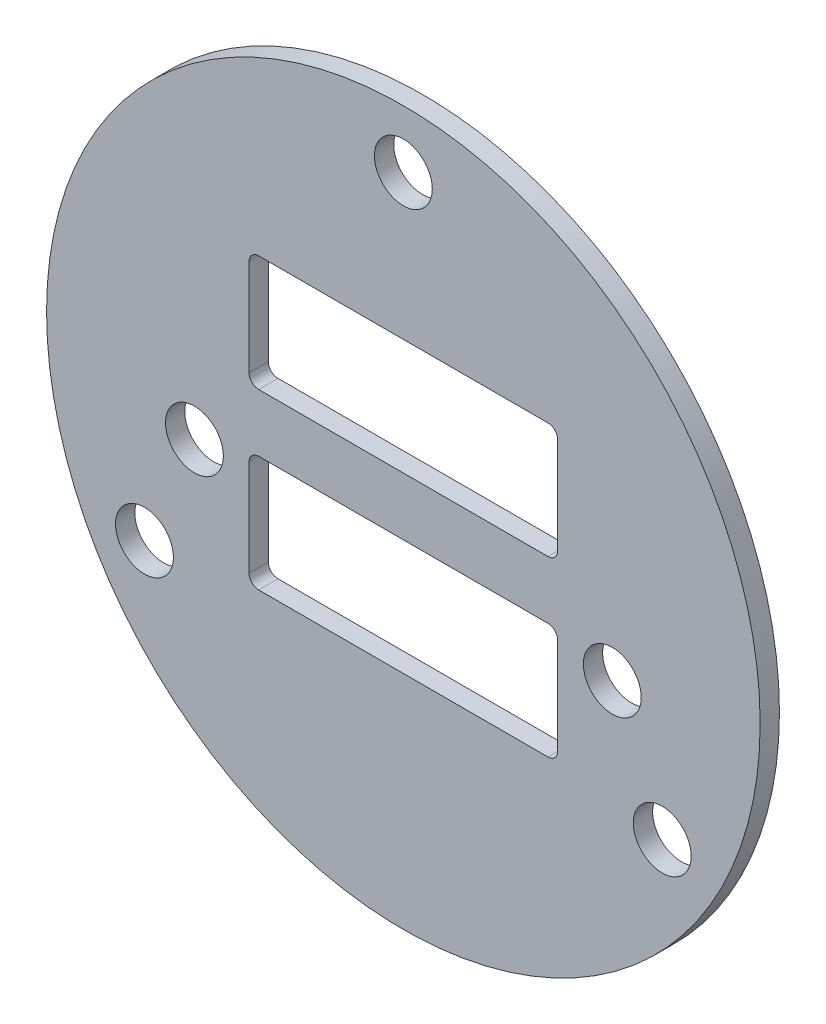
ISO-10303-21;
HEADER;
FILE_DESCRIPTION(('STEP AP214'),'2;1');
FILE_NAME('part.step','',(''),(''),'','','');
FILE_SCHEMA(('AUTOMOTIVE_DESIGN { 1 0 10303 214 1 1 1 1 }'));
ENDSEC;
DATA;
#1=APPLICATION_CONTEXT('core data for automotive mechanical design processes');
#2=APPLICATION_PROTOCOL_DEFINITION('international standard','automotive_design',2000,#1);
#3=PRODUCT_CONTEXT('',#1,'mechanical');
#4=PRODUCT('Part','Part','',(#3));
#5=PRODUCT_RELATED_PRODUCT_CATEGORY('part','',(#4));
#6=PRODUCT_DEFINITION_FORMATION('','',#4);
#7=PRODUCT_DEFINITION_CONTEXT('part definition',#1,'design');
#8=PRODUCT_DEFINITION('design','',#6,#7);
#9=PRODUCT_DEFINITION_SHAPE('','',#8);
#10=(LENGTH_UNIT() NAMED_UNIT(*) SI_UNIT(.MILLI.,.METRE.));
#11=(NAMED_UNIT(*) PLANE_ANGLE_UNIT() SI_UNIT($,.RADIAN.));
#12=(NAMED_UNIT(*) SI_UNIT($,.STERADIAN.) SOLID_ANGLE_UNIT());
#13=UNCERTAINTY_MEASURE_WITH_UNIT(LENGTH_MEASURE(1.E-05),#10,'distance_accuracy_value','');
#14=(GEOMETRIC_REPRESENTATION_CONTEXT(3) GLOBAL_UNCERTAINTY_ASSIGNED_CONTEXT((#13)) GLOBAL_UNIT_ASSIGNED_CONTEXT((#10,
#11,#12)) REPRESENTATION_CONTEXT('',''));
#15=CARTESIAN_POINT('',(0.,0.,0.));
#16=DIRECTION('',(0.,0.,1.));
#17=DIRECTION('',(1.,0.,0.));
#18=AXIS2_PLACEMENT_3D('',#15,#16,#17);
#19=CARTESIAN_POINT('',(0.,0.,0.));
#20=DIRECTION('',(0.,0.,-1.));
#21=DIRECTION('',(-1.,0.,0.));
#22=AXIS2_PLACEMENT_3D('',#19,#20,#21);
#23=PLANE('',#22);
#24=CARTESIAN_POINT('',(0.,0.,0.));
#25=DIRECTION('',(0.,0.,1.));
#26=DIRECTION('',(1.,0.,0.));
#27=AXIS2_PLACEMENT_3D('',#24,#25,#26);
#28=CIRCLE('',#27,18.5);
#29=CARTESIAN_POINT('',(18.5,0.,0.));
#30=VERTEX_POINT('',#29);
#31=EDGE_CURVE('E216',#30,#30,#28,.T.);
#32=ORIENTED_EDGE('',*,*,#31,.F.);
#33=EDGE_LOOP('',(#32));
#34=FACE_BOUND('',#33,.T.);
#35=DIRECTION('',(1.,0.,0.));
#36=VECTOR('',#35,1.);
#37=CARTESIAN_POINT('',(7.5,8.,0.));
#38=LINE('',#37,#36);
#39=CARTESIAN_POINT('',(7.5,8.,0.));
#40=VERTEX_POINT('',#39);
#41=CARTESIAN_POINT('',(-7.5,8.,0.));
#42=VERTEX_POINT('',#41);
#43=EDGE_CURVE('E452',#40,#42,#38,.F.);
#44=ORIENTED_EDGE('',*,*,#43,.T.);
#45=CARTESIAN_POINT('',(-7.5,7.5,0.));
#46=DIRECTION('',(0.,0.,-1.));
#47=DIRECTION('',(-1.,0.,0.));
#48=AXIS2_PLACEMENT_3D('',#45,#46,#47);
#49=CIRCLE('',#48,0.500000000000002);
#50=CARTESIAN_POINT('',(-8.,7.5,0.));
#51=VERTEX_POINT('',#50);
#52=EDGE_CURVE('E220',#42,#51,#49,.F.);
#53=ORIENTED_EDGE('',*,*,#52,.T.);
#54=DIRECTION('',(0.,-1.,0.));
#55=VECTOR('',#54,1.);
#56=CARTESIAN_POINT('',(-8.,7.5,0.));
#57=LINE('',#56,#55);
#58=CARTESIAN_POINT('',(-8.,2.5,0.));
#59=VERTEX_POINT('',#58);
#60=EDGE_CURVE('E219',#51,#59,#57,.T.);
#61=ORIENTED_EDGE('',*,*,#60,.T.);
#62=CARTESIAN_POINT('',(-7.5,2.5,0.));
#63=DIRECTION('',(0.,0.,-1.));
#64=DIRECTION('',(-1.,0.,0.));
#65=AXIS2_PLACEMENT_3D('',#62,#63,#64);
#66=CIRCLE('',#65,0.500000000000001);
#67=CARTESIAN_POINT('',(-7.5,2.,0.));
#68=VERTEX_POINT('',#67);
#69=EDGE_CURVE('E152',#59,#68,#66,.F.);
#70=ORIENTED_EDGE('',*,*,#69,.T.);
#71=DIRECTION('',(1.,0.,0.));
#72=VECTOR('',#71,1.);
#73=CARTESIAN_POINT('',(-7.5,2.,0.));
#74=LINE('',#73,#72);
#75=CARTESIAN_POINT('',(7.5,2.,0.));
#76=VERTEX_POINT('',#75);
#77=EDGE_CURVE('E159',#68,#76,#74,.T.);
#78=ORIENTED_EDGE('',*,*,#77,.T.);
#79=CARTESIAN_POINT('',(7.5,2.5,0.));
#80=DIRECTION('',(0.,0.,-1.));
#81=DIRECTION('',(-1.,0.,0.));
#82=AXIS2_PLACEMENT_3D('',#79,#80,#81);
#83=CIRCLE('',#82,0.5);
#84=CARTESIAN_POINT('',(8.,2.5,0.));
#85=VERTEX_POINT('',#84);
#86=EDGE_CURVE('E228',#76,#85,#83,.F.);
#87=ORIENTED_EDGE('',*,*,#86,.T.);
#88=DIRECTION('',(0.,1.,0.));
#89=VECTOR('',#88,1.);
#90=CARTESIAN_POINT('',(8.,2.5,0.));
#91=LINE('',#90,#89);
#92=CARTESIAN_POINT('',(8.,7.5,0.));
#93=VERTEX_POINT('',#92);
#94=EDGE_CURVE('E469',#85,#93,#91,.T.);
#95=ORIENTED_EDGE('',*,*,#94,.T.);
#96=CARTESIAN_POINT('',(7.5,7.5,0.));
#97=DIRECTION('',(0.,0.,-1.));
#98=DIRECTION('',(-1.,0.,0.));
#99=AXIS2_PLACEMENT_3D('',#96,#97,#98);
#100=CIRCLE('',#99,0.500000000000002);
#101=EDGE_CURVE('E224',#93,#40,#100,.F.);
#102=ORIENTED_EDGE('',*,*,#101,.T.);
#103=EDGE_LOOP('',(#44,#53,#61,#70,#78,#87,#95,#102));
#104=FACE_BOUND('',#103,.T.);
#105=DIRECTION('',(1.,0.,0.));
#106=VECTOR('',#105,1.);
#107=CARTESIAN_POINT('',(7.5,-0.999999999999999,0.));
#108=LINE('',#107,#106);
#109=CARTESIAN_POINT('',(7.5,-0.999999999999999,0.));
#110=VERTEX_POINT('',#109);
#111=CARTESIAN_POINT('',(-7.5,-1.,0.));
#112=VERTEX_POINT('',#111);
#113=EDGE_CURVE('E161',#110,#112,#108,.F.);
#114=ORIENTED_EDGE('',*,*,#113,.T.);
#115=CARTESIAN_POINT('',(-7.5,-1.5,0.));
#116=DIRECTION('',(0.,0.,-1.));
#117=DIRECTION('',(-1.,0.,0.));
#118=AXIS2_PLACEMENT_3D('',#115,#116,#117);
#119=CIRCLE('',#118,0.500000000000001);
#120=CARTESIAN_POINT('',(-8.,-1.5,0.));
#121=VERTEX_POINT('',#120);
#122=EDGE_CURVE('E148',#112,#121,#119,.F.);
#123=ORIENTED_EDGE('',*,*,#122,.T.);
#124=DIRECTION('',(0.,-1.,0.));
#125=VECTOR('',#124,1.);
#126=CARTESIAN_POINT('',(-8.,-1.5,0.));
#127=LINE('',#126,#125);
#128=CARTESIAN_POINT('',(-8.,-6.5,0.));
#129=VERTEX_POINT('',#128);
#130=EDGE_CURVE('E143',#121,#129,#127,.T.);
#131=ORIENTED_EDGE('',*,*,#130,.T.);
#132=CARTESIAN_POINT('',(-7.5,-6.5,0.));
#133=DIRECTION('',(0.,0.,-1.));
#134=DIRECTION('',(-1.,0.,0.));
#135=AXIS2_PLACEMENT_3D('',#132,#133,#134);
#136=CIRCLE('',#135,0.499999999999999);
#137=CARTESIAN_POINT('',(-7.5,-7.,0.));
#138=VERTEX_POINT('',#137);
#139=EDGE_CURVE('E128',#129,#138,#136,.F.);
#140=ORIENTED_EDGE('',*,*,#139,.T.);
#141=DIRECTION('',(1.,0.,0.));
#142=VECTOR('',#141,1.);
#143=CARTESIAN_POINT('',(-7.5,-7.,0.));
#144=LINE('',#143,#142);
#145=CARTESIAN_POINT('',(7.5,-7.,0.));
#146=VERTEX_POINT('',#145);
#147=EDGE_CURVE('E169',#138,#146,#144,.T.);
#148=ORIENTED_EDGE('',*,*,#147,.T.);
#149=CARTESIAN_POINT('',(7.5,-6.5,0.));
#150=DIRECTION('',(0.,0.,-1.));
#151=DIRECTION('',(-1.,0.,0.));
#152=AXIS2_PLACEMENT_3D('',#149,#150,#151);
#153=CIRCLE('',#152,0.499999999999999);
#154=CARTESIAN_POINT('',(8.,-6.5,0.));
#155=VERTEX_POINT('',#154);
#156=EDGE_CURVE('E235',#146,#155,#153,.F.);
#157=ORIENTED_EDGE('',*,*,#156,.T.);
#158=DIRECTION('',(0.,1.,0.));
#159=VECTOR('',#158,1.);
#160=CARTESIAN_POINT('',(8.,-6.5,0.));
#161=LINE('',#160,#159);
#162=CARTESIAN_POINT('',(8.,-1.5,0.));
#163=VERTEX_POINT('',#162);
#164=EDGE_CURVE('E165',#155,#163,#161,.T.);
#165=ORIENTED_EDGE('',*,*,#164,.T.);
#166=CARTESIAN_POINT('',(7.5,-1.5,0.));
#167=DIRECTION('',(0.,0.,-1.));
#168=DIRECTION('',(-1.,0.,0.));
#169=AXIS2_PLACEMENT_3D('',#166,#167,#168);
#170=CIRCLE('',#169,0.5);
#171=EDGE_CURVE('E233',#163,#110,#170,.F.);
#172=ORIENTED_EDGE('',*,*,#171,.T.);
#173=EDGE_LOOP('',(#114,#123,#131,#140,#148,#157,#165,#172));
#174=FACE_BOUND('',#173,.T.);
#175=CARTESIAN_POINT('',(13.4233937586588,-7.74999999999999,0.));
#176=DIRECTION('',(0.,0.,1.));
#177=DIRECTION('',(1.,0.,0.));
#178=AXIS2_PLACEMENT_3D('',#175,#176,#177);
#179=CIRCLE('',#178,1.5);
#180=CARTESIAN_POINT('',(14.9233937586588,-7.74999999999999,0.));
#181=VERTEX_POINT('',#180);
#182=EDGE_CURVE('E138',#181,#181,#179,.T.);
#183=ORIENTED_EDGE('',*,*,#182,.T.);
#184=EDGE_LOOP('',(#183));
#185=FACE_BOUND('',#184,.T.);
#186=CARTESIAN_POINT('',(0.,15.5,0.));
#187=DIRECTION('',(0.,0.,1.));
#188=DIRECTION('',(1.,0.,0.));
#189=AXIS2_PLACEMENT_3D('',#186,#187,#188);
#190=CIRCLE('',#189,1.5);
#191=CARTESIAN_POINT('',(1.5,15.5,0.));
#192=VERTEX_POINT('',#191);
#193=EDGE_CURVE('E239',#192,#192,#190,.T.);
#194=ORIENTED_EDGE('',*,*,#193,.T.);
#195=EDGE_LOOP('',(#194));
#196=FACE_BOUND('',#195,.T.);
#197=CARTESIAN_POINT('',(-13.4233937586588,-7.75,0.));
#198=DIRECTION('',(0.,0.,1.));
#199=DIRECTION('',(1.,0.,0.));
#200=AXIS2_PLACEMENT_3D('',#197,#198,#199);
#201=CIRCLE('',#200,1.5);
#202=CARTESIAN_POINT('',(-11.9233937586588,-7.75,0.));
#203=VERTEX_POINT('',#202);
#204=EDGE_CURVE('E242',#203,#203,#201,.T.);
#205=ORIENTED_EDGE('',*,*,#204,.T.);
#206=EDGE_LOOP('',(#205));
#207=FACE_BOUND('',#206,.T.);
#208=CARTESIAN_POINT('',(10.8328852831343,-1.91012995433623,0.));
#209=DIRECTION('',(0.,0.,1.));
#210=DIRECTION('',(1.,0.,0.));
#211=AXIS2_PLACEMENT_3D('',#208,#209,#210);
#212=CIRCLE('',#211,1.5);
#213=CARTESIAN_POINT('',(12.3328852831343,-1.91012995433623,0.));
#214=VERTEX_POINT('',#213);
#215=EDGE_CURVE('E244',#214,#214,#212,.T.);
#216=ORIENTED_EDGE('',*,*,#215,.T.);
#217=EDGE_LOOP('',(#216));
#218=FACE_BOUND('',#217,.T.);
#219=CARTESIAN_POINT('',(-10.8328852831343,-1.91012995433623,0.));
#220=DIRECTION('',(0.,0.,1.));
#221=DIRECTION('',(1.,0.,0.));
#222=AXIS2_PLACEMENT_3D('',#219,#220,#221);
#223=CIRCLE('',#222,1.5);
#224=CARTESIAN_POINT('',(-9.33288528313429,-1.91012995433623,0.));
#225=VERTEX_POINT('',#224);
#226=EDGE_CURVE('E19',#225,#225,#223,.T.);
#227=ORIENTED_EDGE('',*,*,#226,.T.);
#228=EDGE_LOOP('',(#227));
#229=FACE_BOUND('',#228,.T.);
#230=ADVANCED_FACE('F16',(#34,#104,#174,#185,#196,#207,#218,#229),#23,.T.);
#231=CARTESIAN_POINT('',(-10.8328852831343,-1.91012995433623,-3.));
#232=DIRECTION('',(0.,0.,1.));
#233=DIRECTION('',(1.,0.,0.));
#234=AXIS2_PLACEMENT_3D('',#231,#232,#233);
#235=CYLINDRICAL_SURFACE('',#234,1.5);
#236=ORIENTED_EDGE('',*,*,#226,.F.);
#237=EDGE_LOOP('',(#236));
#238=FACE_BOUND('',#237,.T.);
#239=CARTESIAN_POINT('',(-10.8328852831343,-1.91012995433623,1.));
#240=DIRECTION('',(0.,0.,1.));
#241=DIRECTION('',(1.,0.,0.));
#242=AXIS2_PLACEMENT_3D('',#239,#240,#241);
#243=CIRCLE('',#242,1.5);
#244=CARTESIAN_POINT('',(-9.33288528313429,-1.91012995433623,1.));
#245=VERTEX_POINT('',#244);
#246=EDGE_CURVE('E213',#245,#245,#243,.T.);
#247=ORIENTED_EDGE('',*,*,#246,.T.);
#248=EDGE_LOOP('',(#247));
#249=FACE_BOUND('',#248,.T.);
#250=ADVANCED_FACE('F252',(#238,#249),#235,.F.);
#251=CARTESIAN_POINT('',(10.8328852831343,-1.91012995433623,-3.));
#252=DIRECTION('',(0.,0.,1.));
#253=DIRECTION('',(1.,0.,0.));
#254=AXIS2_PLACEMENT_3D('',#251,#252,#253);
#255=CYLINDRICAL_SURFACE('',#254,1.5);
#256=ORIENTED_EDGE('',*,*,#215,.F.);
#257=EDGE_LOOP('',(#256));
#258=FACE_BOUND('',#257,.T.);
#259=CARTESIAN_POINT('',(10.8328852831343,-1.91012995433623,1.));
#260=DIRECTION('',(0.,0.,1.));
#261=DIRECTION('',(1.,0.,0.));
#262=AXIS2_PLACEMENT_3D('',#259,#260,#261);
#263=CIRCLE('',#262,1.5);
#264=CARTESIAN_POINT('',(12.3328852831343,-1.91012995433623,1.));
#265=VERTEX_POINT('',#264);
#266=EDGE_CURVE('E210',#265,#265,#263,.T.);
#267=ORIENTED_EDGE('',*,*,#266,.T.);
#268=EDGE_LOOP('',(#267));
#269=FACE_BOUND('',#268,.T.);
#270=ADVANCED_FACE('F255',(#258,#269),#255,.F.);
#271=CARTESIAN_POINT('',(-13.4233937586588,-7.75,0.5));
#272=DIRECTION('',(0.,0.,1.));
#273=DIRECTION('',(1.,0.,0.));
#274=AXIS2_PLACEMENT_3D('',#271,#272,#273);
#275=CYLINDRICAL_SURFACE('',#274,1.5);
#276=ORIENTED_EDGE('',*,*,#204,.F.);
#277=EDGE_LOOP('',(#276));
#278=FACE_BOUND('',#277,.T.);
#279=CARTESIAN_POINT('',(-13.4233937586588,-7.75,1.));
#280=DIRECTION('',(0.,0.,1.));
#281=DIRECTION('',(1.,0.,0.));
#282=AXIS2_PLACEMENT_3D('',#279,#280,#281);
#283=CIRCLE('',#282,1.5);
#284=CARTESIAN_POINT('',(-11.9233937586588,-7.75,1.));
#285=VERTEX_POINT('',#284);
#286=EDGE_CURVE('E207',#285,#285,#283,.T.);
#287=ORIENTED_EDGE('',*,*,#286,.T.);
#288=EDGE_LOOP('',(#287));
#289=FACE_BOUND('',#288,.T.);
#290=ADVANCED_FACE('F338',(#278,#289),#275,.F.);
#291=CARTESIAN_POINT('',(0.,15.5,0.5));
#292=DIRECTION('',(0.,0.,1.));
#293=DIRECTION('',(1.,0.,0.));
#294=AXIS2_PLACEMENT_3D('',#291,#292,#293);
#295=CYLINDRICAL_SURFACE('',#294,1.5);
#296=ORIENTED_EDGE('',*,*,#193,.F.);
#297=EDGE_LOOP('',(#296));
#298=FACE_BOUND('',#297,.T.);
#299=CARTESIAN_POINT('',(0.,15.5,1.));
#300=DIRECTION('',(0.,0.,1.));
#301=DIRECTION('',(1.,0.,0.));
#302=AXIS2_PLACEMENT_3D('',#299,#300,#301);
#303=CIRCLE('',#302,1.5);
#304=CARTESIAN_POINT('',(1.5,15.5,1.));
#305=VERTEX_POINT('',#304);
#306=EDGE_CURVE('E204',#305,#305,#303,.T.);
#307=ORIENTED_EDGE('',*,*,#306,.T.);
#308=EDGE_LOOP('',(#307));
#309=FACE_BOUND('',#308,.T.);
#310=ADVANCED_FACE('F334',(#298,#309),#295,.F.);
#311=CARTESIAN_POINT('',(13.4233937586588,-7.74999999999999,0.5));
#312=DIRECTION('',(0.,0.,1.));
#313=DIRECTION('',(1.,0.,0.));
#314=AXIS2_PLACEMENT_3D('',#311,#312,#313);
#315=CYLINDRICAL_SURFACE('',#314,1.5);
#316=ORIENTED_EDGE('',*,*,#182,.F.);
#317=EDGE_LOOP('',(#316));
#318=FACE_BOUND('',#317,.T.);
#319=CARTESIAN_POINT('',(13.4233937586588,-7.74999999999999,1.));
#320=DIRECTION('',(0.,0.,1.));
#321=DIRECTION('',(1.,0.,0.));
#322=AXIS2_PLACEMENT_3D('',#319,#320,#321);
#323=CIRCLE('',#322,1.5);
#324=CARTESIAN_POINT('',(14.9233937586588,-7.74999999999999,1.));
#325=VERTEX_POINT('',#324);
#326=EDGE_CURVE('E201',#325,#325,#323,.T.);
#327=ORIENTED_EDGE('',*,*,#326,.T.);
#328=EDGE_LOOP('',(#327));
#329=FACE_BOUND('',#328,.T.);
#330=ADVANCED_FACE('F331',(#318,#329),#315,.F.);
#331=CARTESIAN_POINT('',(-7.5,-6.5,1.));
#332=DIRECTION('',(0.,0.,-1.));
#333=DIRECTION('',(-1.,0.,0.));
#334=AXIS2_PLACEMENT_3D('',#331,#332,#333);
#335=CYLINDRICAL_SURFACE('',#334,0.499999999999999);
#336=DIRECTION('',(0.,0.,1.));
#337=VECTOR('',#336,1.);
#338=CARTESIAN_POINT('',(-8.,-6.5,1.));
#339=LINE('',#338,#337);
#340=CARTESIAN_POINT('',(-8.,-6.5,1.));
#341=VERTEX_POINT('',#340);
#342=EDGE_CURVE('E132',#129,#341,#339,.T.);
#343=ORIENTED_EDGE('',*,*,#342,.T.);
#344=CARTESIAN_POINT('',(-7.5,-6.5,1.));
#345=DIRECTION('',(0.,0.,-1.));
#346=DIRECTION('',(-1.,0.,0.));
#347=AXIS2_PLACEMENT_3D('',#344,#345,#346);
#348=CIRCLE('',#347,0.499999999999999);
#349=CARTESIAN_POINT('',(-7.5,-7.,1.));
#350=VERTEX_POINT('',#349);
#351=EDGE_CURVE('E199',#341,#350,#348,.F.);
#352=ORIENTED_EDGE('',*,*,#351,.T.);
#353=DIRECTION('',(0.,0.,-1.));
#354=VECTOR('',#353,1.);
#355=CARTESIAN_POINT('',(-7.5,-7.,1.));
#356=LINE('',#355,#354);
#357=EDGE_CURVE('E134',#350,#138,#356,.T.);
#358=ORIENTED_EDGE('',*,*,#357,.T.);
#359=ORIENTED_EDGE('',*,*,#139,.F.);
#360=EDGE_LOOP('',(#343,#352,#358,#359));
#361=FACE_BOUND('',#360,.T.);
#362=ADVANCED_FACE('F130',(#361),#335,.F.);
#363=CARTESIAN_POINT('',(-7.5,-7.,1.));
#364=DIRECTION('',(0.,-1.,0.));
#365=DIRECTION('',(0.,0.,-1.));
#366=AXIS2_PLACEMENT_3D('',#363,#364,#365);
#367=PLANE('',#366);
#368=ORIENTED_EDGE('',*,*,#357,.F.);
#369=DIRECTION('',(-1.,0.,0.));
#370=VECTOR('',#369,1.);
#371=CARTESIAN_POINT('',(0.,-7.,1.));
#372=LINE('',#371,#370);
#373=CARTESIAN_POINT('',(7.5,-7.,1.));
#374=VERTEX_POINT('',#373);
#375=EDGE_CURVE('E198',#350,#374,#372,.F.);
#376=ORIENTED_EDGE('',*,*,#375,.T.);
#377=DIRECTION('',(0.,0.,-1.));
#378=VECTOR('',#377,1.);
#379=CARTESIAN_POINT('',(7.5,-7.,1.));
#380=LINE('',#379,#378);
#381=EDGE_CURVE('E170',#374,#146,#380,.T.);
#382=ORIENTED_EDGE('',*,*,#381,.T.);
#383=ORIENTED_EDGE('',*,*,#147,.F.);
#384=EDGE_LOOP('',(#368,#376,#382,#383));
#385=FACE_BOUND('',#384,.T.);
#386=ADVANCED_FACE('F324',(#385),#367,.F.);
#387=CARTESIAN_POINT('',(7.5,-6.5,1.));
#388=DIRECTION('',(0.,0.,-1.));
#389=DIRECTION('',(-1.,0.,0.));
#390=AXIS2_PLACEMENT_3D('',#387,#388,#389);
#391=CYLINDRICAL_SURFACE('',#390,0.499999999999999);
#392=ORIENTED_EDGE('',*,*,#381,.F.);
#393=CARTESIAN_POINT('',(7.5,-6.5,1.));
#394=DIRECTION('',(0.,0.,-1.));
#395=DIRECTION('',(-1.,0.,0.));
#396=AXIS2_PLACEMENT_3D('',#393,#394,#395);
#397=CIRCLE('',#396,0.499999999999999);
#398=CARTESIAN_POINT('',(8.,-6.5,1.));
#399=VERTEX_POINT('',#398);
#400=EDGE_CURVE('E195',#374,#399,#397,.F.);
#401=ORIENTED_EDGE('',*,*,#400,.T.);
#402=DIRECTION('',(0.,0.,-1.));
#403=VECTOR('',#402,1.);
#404=CARTESIAN_POINT('',(8.,-6.5,1.));
#405=LINE('',#404,#403);
#406=EDGE_CURVE('E168',#399,#155,#405,.T.);
#407=ORIENTED_EDGE('',*,*,#406,.T.);
#408=ORIENTED_EDGE('',*,*,#156,.F.);
#409=EDGE_LOOP('',(#392,#401,#407,#408));
#410=FACE_BOUND('',#409,.T.);
#411=ADVANCED_FACE('F320',(#410),#391,.F.);
#412=CARTESIAN_POINT('',(8.,-6.5,1.));
#413=DIRECTION('',(1.,0.,0.));
#414=DIRECTION('',(0.,0.,-1.));
#415=AXIS2_PLACEMENT_3D('',#412,#413,#414);
#416=PLANE('',#415);
#417=ORIENTED_EDGE('',*,*,#406,.F.);
#418=DIRECTION('',(0.,1.,0.));
#419=VECTOR('',#418,1.);
#420=CARTESIAN_POINT('',(8.,0.,1.));
#421=LINE('',#420,#419);
#422=CARTESIAN_POINT('',(8.,-1.5,1.));
#423=VERTEX_POINT('',#422);
#424=EDGE_CURVE('E194',#399,#423,#421,.T.);
#425=ORIENTED_EDGE('',*,*,#424,.T.);
#426=DIRECTION('',(0.,0.,-1.));
#427=VECTOR('',#426,1.);
#428=CARTESIAN_POINT('',(8.,-1.5,1.));
#429=LINE('',#428,#427);
#430=EDGE_CURVE('E167',#423,#163,#429,.T.);
#431=ORIENTED_EDGE('',*,*,#430,.T.);
#432=ORIENTED_EDGE('',*,*,#164,.F.);
#433=EDGE_LOOP('',(#417,#425,#431,#432));
#434=FACE_BOUND('',#433,.T.);
#435=ADVANCED_FACE('F316',(#434),#416,.F.);
#436=CARTESIAN_POINT('',(7.5,-1.5,1.));
#437=DIRECTION('',(0.,0.,-1.));
#438=DIRECTION('',(-1.,0.,0.));
#439=AXIS2_PLACEMENT_3D('',#436,#437,#438);
#440=CYLINDRICAL_SURFACE('',#439,0.5);
#441=ORIENTED_EDGE('',*,*,#430,.F.);
#442=CARTESIAN_POINT('',(7.5,-1.5,1.));
#443=DIRECTION('',(0.,0.,-1.));
#444=DIRECTION('',(-1.,0.,0.));
#445=AXIS2_PLACEMENT_3D('',#442,#443,#444);
#446=CIRCLE('',#445,0.5);
#447=CARTESIAN_POINT('',(7.5,-0.999999999999999,1.));
#448=VERTEX_POINT('',#447);
#449=EDGE_CURVE('E191',#423,#448,#446,.F.);
#450=ORIENTED_EDGE('',*,*,#449,.T.);
#451=DIRECTION('',(0.,0.,1.));
#452=VECTOR('',#451,1.);
#453=CARTESIAN_POINT('',(7.5,-0.999999999999999,1.));
#454=LINE('',#453,#452);
#455=EDGE_CURVE('E164',#448,#110,#454,.F.);
#456=ORIENTED_EDGE('',*,*,#455,.T.);
#457=ORIENTED_EDGE('',*,*,#171,.F.);
#458=EDGE_LOOP('',(#441,#450,#456,#457));
#459=FACE_BOUND('',#458,.T.);
#460=ADVANCED_FACE('F312',(#459),#440,.F.);
#461=CARTESIAN_POINT('',(7.5,-0.999999999999999,1.));
#462=DIRECTION('',(0.,1.,0.));
#463=DIRECTION('',(0.,0.,1.));
#464=AXIS2_PLACEMENT_3D('',#461,#462,#463);
#465=PLANE('',#464);
#466=ORIENTED_EDGE('',*,*,#455,.F.);
#467=DIRECTION('',(-1.,0.,0.));
#468=VECTOR('',#467,1.);
#469=CARTESIAN_POINT('',(0.,-0.999999999999999,1.));
#470=LINE('',#469,#468);
#471=CARTESIAN_POINT('',(-7.5,-1.,1.));
#472=VERTEX_POINT('',#471);
#473=EDGE_CURVE('E190',#448,#472,#470,.T.);
#474=ORIENTED_EDGE('',*,*,#473,.T.);
#475=DIRECTION('',(0.,0.,-1.));
#476=VECTOR('',#475,1.);
#477=CARTESIAN_POINT('',(-7.5,-1.,1.));
#478=LINE('',#477,#476);
#479=EDGE_CURVE('E163',#472,#112,#478,.T.);
#480=ORIENTED_EDGE('',*,*,#479,.T.);
#481=ORIENTED_EDGE('',*,*,#113,.F.);
#482=EDGE_LOOP('',(#466,#474,#480,#481));
#483=FACE_BOUND('',#482,.T.);
#484=ADVANCED_FACE('F308',(#483),#465,.F.);
#485=CARTESIAN_POINT('',(-7.5,-1.5,1.));
#486=DIRECTION('',(0.,0.,-1.));
#487=DIRECTION('',(-1.,0.,0.));
#488=AXIS2_PLACEMENT_3D('',#485,#486,#487);
#489=CYLINDRICAL_SURFACE('',#488,0.500000000000001);
#490=ORIENTED_EDGE('',*,*,#479,.F.);
#491=CARTESIAN_POINT('',(-7.5,-1.5,1.));
#492=DIRECTION('',(0.,0.,-1.));
#493=DIRECTION('',(-1.,0.,0.));
#494=AXIS2_PLACEMENT_3D('',#491,#492,#493);
#495=CIRCLE('',#494,0.500000000000001);
#496=CARTESIAN_POINT('',(-8.,-1.5,1.));
#497=VERTEX_POINT('',#496);
#498=EDGE_CURVE('E187',#472,#497,#495,.F.);
#499=ORIENTED_EDGE('',*,*,#498,.T.);
#500=DIRECTION('',(0.,0.,1.));
#501=VECTOR('',#500,1.);
#502=CARTESIAN_POINT('',(-8.,-1.5,1.));
#503=LINE('',#502,#501);
#504=EDGE_CURVE('E147',#497,#121,#503,.F.);
#505=ORIENTED_EDGE('',*,*,#504,.T.);
#506=ORIENTED_EDGE('',*,*,#122,.F.);
#507=EDGE_LOOP('',(#490,#499,#505,#506));
#508=FACE_BOUND('',#507,.T.);
#509=ADVANCED_FACE('F305',(#508),#489,.F.);
#510=CARTESIAN_POINT('',(-8.,-1.5,1.));
#511=DIRECTION('',(-1.,0.,0.));
#512=DIRECTION('',(0.,-1.,0.));
#513=AXIS2_PLACEMENT_3D('',#510,#511,#512);
#514=PLANE('',#513);
#515=ORIENTED_EDGE('',*,*,#504,.F.);
#516=DIRECTION('',(0.,1.,0.));
#517=VECTOR('',#516,1.);
#518=CARTESIAN_POINT('',(-8.,0.,1.));
#519=LINE('',#518,#517);
#520=EDGE_CURVE('E146',#497,#341,#519,.F.);
#521=ORIENTED_EDGE('',*,*,#520,.T.);
#522=ORIENTED_EDGE('',*,*,#342,.F.);
#523=ORIENTED_EDGE('',*,*,#130,.F.);
#524=EDGE_LOOP('',(#515,#521,#522,#523));
#525=FACE_BOUND('',#524,.T.);
#526=ADVANCED_FACE('F142',(#525),#514,.F.);
#527=CARTESIAN_POINT('',(-7.5,2.5,1.));
#528=DIRECTION('',(0.,0.,-1.));
#529=DIRECTION('',(-1.,0.,0.));
#530=AXIS2_PLACEMENT_3D('',#527,#528,#529);
#531=CYLINDRICAL_SURFACE('',#530,0.500000000000001);
#532=DIRECTION('',(0.,0.,1.));
#533=VECTOR('',#532,1.);
#534=CARTESIAN_POINT('',(-8.,2.5,1.));
#535=LINE('',#534,#533);
#536=CARTESIAN_POINT('',(-8.,2.5,1.));
#537=VERTEX_POINT('',#536);
#538=EDGE_CURVE('E222',#59,#537,#535,.T.);
#539=ORIENTED_EDGE('',*,*,#538,.T.);
#540=CARTESIAN_POINT('',(-7.5,2.5,1.));
#541=DIRECTION('',(0.,0.,-1.));
#542=DIRECTION('',(-1.,0.,0.));
#543=AXIS2_PLACEMENT_3D('',#540,#541,#542);
#544=CIRCLE('',#543,0.500000000000001);
#545=CARTESIAN_POINT('',(-7.5,2.,1.));
#546=VERTEX_POINT('',#545);
#547=EDGE_CURVE('E184',#537,#546,#544,.F.);
#548=ORIENTED_EDGE('',*,*,#547,.T.);
#549=DIRECTION('',(0.,0.,-1.));
#550=VECTOR('',#549,1.);
#551=CARTESIAN_POINT('',(-7.5,2.,1.));
#552=LINE('',#551,#550);
#553=EDGE_CURVE('E154',#546,#68,#552,.T.);
#554=ORIENTED_EDGE('',*,*,#553,.T.);
#555=ORIENTED_EDGE('',*,*,#69,.F.);
#556=EDGE_LOOP('',(#539,#548,#554,#555));
#557=FACE_BOUND('',#556,.T.);
#558=ADVANCED_FACE('F298',(#557),#531,.F.);
#559=CARTESIAN_POINT('',(-7.5,2.,1.));
#560=DIRECTION('',(0.,-1.,0.));
#561=DIRECTION('',(0.,0.,-1.));
#562=AXIS2_PLACEMENT_3D('',#559,#560,#561);
#563=PLANE('',#562);
#564=ORIENTED_EDGE('',*,*,#553,.F.);
#565=DIRECTION('',(-1.,0.,0.));
#566=VECTOR('',#565,1.);
#567=CARTESIAN_POINT('',(0.,2.,1.));
#568=LINE('',#567,#566);
#569=CARTESIAN_POINT('',(7.5,2.,1.));
#570=VERTEX_POINT('',#569);
#571=EDGE_CURVE('E183',#546,#570,#568,.F.);
#572=ORIENTED_EDGE('',*,*,#571,.T.);
#573=DIRECTION('',(0.,0.,-1.));
#574=VECTOR('',#573,1.);
#575=CARTESIAN_POINT('',(7.5,2.,1.));
#576=LINE('',#575,#574);
#577=EDGE_CURVE('E230',#570,#76,#576,.T.);
#578=ORIENTED_EDGE('',*,*,#577,.T.);
#579=ORIENTED_EDGE('',*,*,#77,.F.);
#580=EDGE_LOOP('',(#564,#572,#578,#579));
#581=FACE_BOUND('',#580,.T.);
#582=ADVANCED_FACE('F294',(#581),#563,.F.);
#583=CARTESIAN_POINT('',(7.5,2.5,1.));
#584=DIRECTION('',(0.,0.,-1.));
#585=DIRECTION('',(-1.,0.,0.));
#586=AXIS2_PLACEMENT_3D('',#583,#584,#585);
#587=CYLINDRICAL_SURFACE('',#586,0.5);
#588=ORIENTED_EDGE('',*,*,#577,.F.);
#589=CARTESIAN_POINT('',(7.5,2.5,1.));
#590=DIRECTION('',(0.,0.,-1.));
#591=DIRECTION('',(-1.,0.,0.));
#592=AXIS2_PLACEMENT_3D('',#589,#590,#591);
#593=CIRCLE('',#592,0.5);
#594=CARTESIAN_POINT('',(8.,2.5,1.));
#595=VERTEX_POINT('',#594);
#596=EDGE_CURVE('E180',#570,#595,#593,.F.);
#597=ORIENTED_EDGE('',*,*,#596,.T.);
#598=DIRECTION('',(0.,0.,-1.));
#599=VECTOR('',#598,1.);
#600=CARTESIAN_POINT('',(8.,2.5,1.));
#601=LINE('',#600,#599);
#602=EDGE_CURVE('E229',#595,#85,#601,.T.);
#603=ORIENTED_EDGE('',*,*,#602,.T.);
#604=ORIENTED_EDGE('',*,*,#86,.F.);
#605=EDGE_LOOP('',(#588,#597,#603,#604));
#606=FACE_BOUND('',#605,.T.);
#607=ADVANCED_FACE('F290',(#606),#587,.F.);
#608=CARTESIAN_POINT('',(8.,2.5,1.));
#609=DIRECTION('',(1.,0.,0.));
#610=DIRECTION('',(0.,0.,-1.));
#611=AXIS2_PLACEMENT_3D('',#608,#609,#610);
#612=PLANE('',#611);
#613=ORIENTED_EDGE('',*,*,#602,.F.);
#614=DIRECTION('',(0.,1.,0.));
#615=VECTOR('',#614,1.);
#616=CARTESIAN_POINT('',(8.,0.,1.));
#617=LINE('',#616,#615);
#618=CARTESIAN_POINT('',(8.,7.5,1.));
#619=VERTEX_POINT('',#618);
#620=EDGE_CURVE('E179',#595,#619,#617,.T.);
#621=ORIENTED_EDGE('',*,*,#620,.T.);
#622=DIRECTION('',(0.,0.,-1.));
#623=VECTOR('',#622,1.);
#624=CARTESIAN_POINT('',(8.,7.5,1.));
#625=LINE('',#624,#623);
#626=EDGE_CURVE('E227',#619,#93,#625,.T.);
#627=ORIENTED_EDGE('',*,*,#626,.T.);
#628=ORIENTED_EDGE('',*,*,#94,.F.);
#629=EDGE_LOOP('',(#613,#621,#627,#628));
#630=FACE_BOUND('',#629,.T.);
#631=ADVANCED_FACE('F286',(#630),#612,.F.);
#632=CARTESIAN_POINT('',(7.5,7.5,1.));
#633=DIRECTION('',(0.,0.,-1.));
#634=DIRECTION('',(-1.,0.,0.));
#635=AXIS2_PLACEMENT_3D('',#632,#633,#634);
#636=CYLINDRICAL_SURFACE('',#635,0.500000000000002);
#637=ORIENTED_EDGE('',*,*,#626,.F.);
#638=CARTESIAN_POINT('',(7.5,7.5,1.));
#639=DIRECTION('',(0.,0.,-1.));
#640=DIRECTION('',(-1.,0.,0.));
#641=AXIS2_PLACEMENT_3D('',#638,#639,#640);
#642=CIRCLE('',#641,0.500000000000002);
#643=CARTESIAN_POINT('',(7.5,8.,1.));
#644=VERTEX_POINT('',#643);
#645=EDGE_CURVE('E176',#619,#644,#642,.F.);
#646=ORIENTED_EDGE('',*,*,#645,.T.);
#647=DIRECTION('',(0.,0.,1.));
#648=VECTOR('',#647,1.);
#649=CARTESIAN_POINT('',(7.5,8.,1.));
#650=LINE('',#649,#648);
#651=EDGE_CURVE('E226',#644,#40,#650,.F.);
#652=ORIENTED_EDGE('',*,*,#651,.T.);
#653=ORIENTED_EDGE('',*,*,#101,.F.);
#654=EDGE_LOOP('',(#637,#646,#652,#653));
#655=FACE_BOUND('',#654,.T.);
#656=ADVANCED_FACE('F282',(#655),#636,.F.);
#657=CARTESIAN_POINT('',(7.5,8.,1.));
#658=DIRECTION('',(0.,1.,0.));
#659=DIRECTION('',(0.,0.,1.));
#660=AXIS2_PLACEMENT_3D('',#657,#658,#659);
#661=PLANE('',#660);
#662=ORIENTED_EDGE('',*,*,#651,.F.);
#663=DIRECTION('',(-1.,0.,0.));
#664=VECTOR('',#663,1.);
#665=CARTESIAN_POINT('',(0.,8.,1.));
#666=LINE('',#665,#664);
#667=CARTESIAN_POINT('',(-7.5,8.,1.));
#668=VERTEX_POINT('',#667);
#669=EDGE_CURVE('E175',#644,#668,#666,.T.);
#670=ORIENTED_EDGE('',*,*,#669,.T.);
#671=DIRECTION('',(0.,0.,-1.));
#672=VECTOR('',#671,1.);
#673=CARTESIAN_POINT('',(-7.5,8.,1.));
#674=LINE('',#673,#672);
#675=EDGE_CURVE('E223',#668,#42,#674,.T.);
#676=ORIENTED_EDGE('',*,*,#675,.T.);
#677=ORIENTED_EDGE('',*,*,#43,.F.);
#678=EDGE_LOOP('',(#662,#670,#676,#677));
#679=FACE_BOUND('',#678,.T.);
#680=ADVANCED_FACE('F278',(#679),#661,.F.);
#681=CARTESIAN_POINT('',(-7.5,7.5,1.));
#682=DIRECTION('',(0.,0.,-1.));
#683=DIRECTION('',(-1.,0.,0.));
#684=AXIS2_PLACEMENT_3D('',#681,#682,#683);
#685=CYLINDRICAL_SURFACE('',#684,0.500000000000002);
#686=ORIENTED_EDGE('',*,*,#675,.F.);
#687=CARTESIAN_POINT('',(-7.5,7.5,1.));
#688=DIRECTION('',(0.,0.,-1.));
#689=DIRECTION('',(-1.,0.,0.));
#690=AXIS2_PLACEMENT_3D('',#687,#688,#689);
#691=CIRCLE('',#690,0.500000000000002);
#692=CARTESIAN_POINT('',(-8.,7.5,1.));
#693=VERTEX_POINT('',#692);
#694=EDGE_CURVE('E172',#668,#693,#691,.F.);
#695=ORIENTED_EDGE('',*,*,#694,.T.);
#696=DIRECTION('',(0.,0.,1.));
#697=VECTOR('',#696,1.);
#698=CARTESIAN_POINT('',(-8.,7.5,1.));
#699=LINE('',#698,#697);
#700=EDGE_CURVE('E34',#693,#51,#699,.F.);
#701=ORIENTED_EDGE('',*,*,#700,.T.);
#702=ORIENTED_EDGE('',*,*,#52,.F.);
#703=EDGE_LOOP('',(#686,#695,#701,#702));
#704=FACE_BOUND('',#703,.T.);
#705=ADVANCED_FACE('F275',(#704),#685,.F.);
#706=CARTESIAN_POINT('',(-8.,7.5,1.));
#707=DIRECTION('',(-1.,0.,0.));
#708=DIRECTION('',(0.,-1.,0.));
#709=AXIS2_PLACEMENT_3D('',#706,#707,#708);
#710=PLANE('',#709);
#711=ORIENTED_EDGE('',*,*,#700,.F.);
#712=DIRECTION('',(0.,1.,0.));
#713=VECTOR('',#712,1.);
#714=CARTESIAN_POINT('',(-8.,0.,1.));
#715=LINE('',#714,#713);
#716=EDGE_CURVE('E25',#693,#537,#715,.F.);
#717=ORIENTED_EDGE('',*,*,#716,.T.);
#718=ORIENTED_EDGE('',*,*,#538,.F.);
#719=ORIENTED_EDGE('',*,*,#60,.F.);
#720=EDGE_LOOP('',(#711,#717,#718,#719));
#721=FACE_BOUND('',#720,.T.);
#722=ADVANCED_FACE('F267',(#721),#710,.F.);
#723=CARTESIAN_POINT('',(0.,0.,0.));
#724=DIRECTION('',(0.,0.,1.));
#725=DIRECTION('',(1.,0.,0.));
#726=AXIS2_PLACEMENT_3D('',#723,#724,#725);
#727=CYLINDRICAL_SURFACE('',#726,18.5);
#728=ORIENTED_EDGE('',*,*,#31,.T.);
#729=EDGE_LOOP('',(#728));
#730=FACE_BOUND('',#729,.T.);
#731=CARTESIAN_POINT('',(0.,0.,1.));
#732=DIRECTION('',(0.,0.,1.));
#733=DIRECTION('',(1.,0.,0.));
#734=AXIS2_PLACEMENT_3D('',#731,#732,#733);
#735=CIRCLE('',#734,18.5);
#736=CARTESIAN_POINT('',(18.5,0.,1.));
#737=VERTEX_POINT('',#736);
#738=EDGE_CURVE('E10',#737,#737,#735,.F.);
#739=ORIENTED_EDGE('',*,*,#738,.T.);
#740=EDGE_LOOP('',(#739));
#741=FACE_BOUND('',#740,.T.);
#742=ADVANCED_FACE('F260',(#730,#741),#727,.T.);
#743=CARTESIAN_POINT('',(0.,0.,1.));
#744=DIRECTION('',(0.,0.,-1.));
#745=DIRECTION('',(-1.,0.,0.));
#746=AXIS2_PLACEMENT_3D('',#743,#744,#745);
#747=PLANE('',#746);
#748=ORIENTED_EDGE('',*,*,#738,.F.);
#749=EDGE_LOOP('',(#748));
#750=FACE_BOUND('',#749,.T.);
#751=ORIENTED_EDGE('',*,*,#694,.F.);
#752=ORIENTED_EDGE('',*,*,#669,.F.);
#753=ORIENTED_EDGE('',*,*,#645,.F.);
#754=ORIENTED_EDGE('',*,*,#620,.F.);
#755=ORIENTED_EDGE('',*,*,#596,.F.);
#756=ORIENTED_EDGE('',*,*,#571,.F.);
#757=ORIENTED_EDGE('',*,*,#547,.F.);
#758=ORIENTED_EDGE('',*,*,#716,.F.);
#759=EDGE_LOOP('',(#751,#752,#753,#754,#755,#756,#757,#758));
#760=FACE_BOUND('',#759,.T.);
#761=ORIENTED_EDGE('',*,*,#498,.F.);
#762=ORIENTED_EDGE('',*,*,#473,.F.);
#763=ORIENTED_EDGE('',*,*,#449,.F.);
#764=ORIENTED_EDGE('',*,*,#424,.F.);
#765=ORIENTED_EDGE('',*,*,#400,.F.);
#766=ORIENTED_EDGE('',*,*,#375,.F.);
#767=ORIENTED_EDGE('',*,*,#351,.F.);
#768=ORIENTED_EDGE('',*,*,#520,.F.);
#769=EDGE_LOOP('',(#761,#762,#763,#764,#765,#766,#767,#768));
#770=FACE_BOUND('',#769,.T.);
#771=ORIENTED_EDGE('',*,*,#326,.F.);
#772=EDGE_LOOP('',(#771));
#773=FACE_BOUND('',#772,.T.);
#774=ORIENTED_EDGE('',*,*,#306,.F.);
#775=EDGE_LOOP('',(#774));
#776=FACE_BOUND('',#775,.T.);
#777=ORIENTED_EDGE('',*,*,#286,.F.);
#778=EDGE_LOOP('',(#777));
#779=FACE_BOUND('',#778,.T.);
#780=ORIENTED_EDGE('',*,*,#266,.F.);
#781=EDGE_LOOP('',(#780));
#782=FACE_BOUND('',#781,.T.);
#783=ORIENTED_EDGE('',*,*,#246,.F.);
#784=EDGE_LOOP('',(#783));
#785=FACE_BOUND('',#784,.T.);
#786=ADVANCED_FACE('F258',(#750,#760,#770,#773,#776,#779,#782,#785),#747,.F.);
#787=CLOSED_SHELL('',(#230,#250,#270,#290,#310,#330,#362,#386,#411,#435,#460,#484,#509,#526,
#558,#582,#607,#631,#656,#680,#705,#722,#742,#786));
#788=MANIFOLD_SOLID_BREP('B1',#787);
#789=ADVANCED_BREP_SHAPE_REPRESENTATION('',(#18,#788),#14);
#790=SHAPE_DEFINITION_REPRESENTATION(#9,#789);
ENDSEC;
END-ISO-10303-21;
